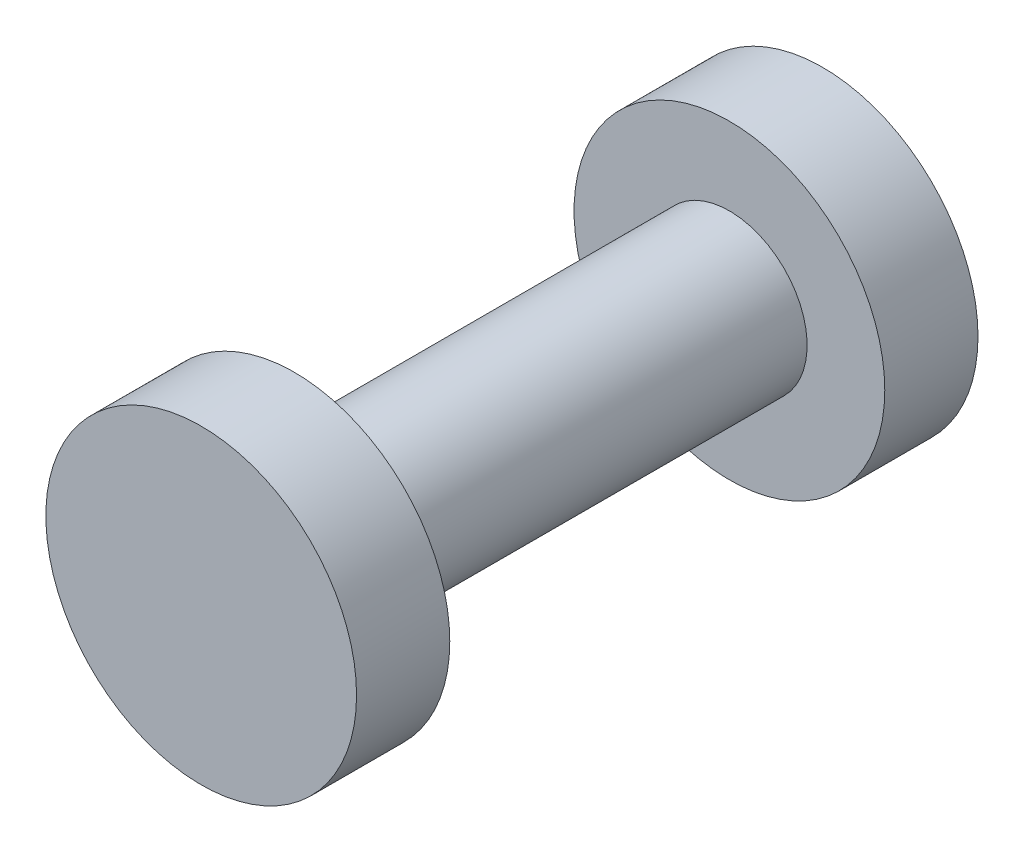
ISO-10303-21;
HEADER;
FILE_DESCRIPTION(('STEP AP214'),'2;1');
FILE_NAME('part.step','',(''),(''),'','','');
FILE_SCHEMA(('AUTOMOTIVE_DESIGN { 1 0 10303 214 1 1 1 1 }'));
ENDSEC;
DATA;
#1=APPLICATION_CONTEXT('core data for automotive mechanical design processes');
#2=APPLICATION_PROTOCOL_DEFINITION('international standard','automotive_design',2000,#1);
#3=PRODUCT_CONTEXT('',#1,'mechanical');
#4=PRODUCT('Part','Part','',(#3));
#5=PRODUCT_RELATED_PRODUCT_CATEGORY('part','',(#4));
#6=PRODUCT_DEFINITION_FORMATION('','',#4);
#7=PRODUCT_DEFINITION_CONTEXT('part definition',#1,'design');
#8=PRODUCT_DEFINITION('design','',#6,#7);
#9=PRODUCT_DEFINITION_SHAPE('','',#8);
#10=(LENGTH_UNIT() NAMED_UNIT(*) SI_UNIT(.MILLI.,.METRE.));
#11=(NAMED_UNIT(*) PLANE_ANGLE_UNIT() SI_UNIT($,.RADIAN.));
#12=(NAMED_UNIT(*) SI_UNIT($,.STERADIAN.) SOLID_ANGLE_UNIT());
#13=UNCERTAINTY_MEASURE_WITH_UNIT(LENGTH_MEASURE(1.E-05),#10,'distance_accuracy_value','');
#14=(GEOMETRIC_REPRESENTATION_CONTEXT(3) GLOBAL_UNCERTAINTY_ASSIGNED_CONTEXT((#13)) GLOBAL_UNIT_ASSIGNED_CONTEXT((#10,
#11,#12)) REPRESENTATION_CONTEXT('',''));
#15=CARTESIAN_POINT('',(0.,0.,0.));
#16=DIRECTION('',(0.,0.,1.));
#17=DIRECTION('',(1.,0.,0.));
#18=AXIS2_PLACEMENT_3D('',#15,#16,#17);
#19=CARTESIAN_POINT('',(0.,0.,6.));
#20=DIRECTION('',(0.,0.,-1.));
#21=DIRECTION('',(-1.,0.,0.));
#22=AXIS2_PLACEMENT_3D('',#19,#20,#21);
#23=CYLINDRICAL_SURFACE('',#22,1.5);
#24=CARTESIAN_POINT('',(0.,0.,4.2));
#25=DIRECTION('',(0.,0.,1.));
#26=DIRECTION('',(1.,0.,0.));
#27=AXIS2_PLACEMENT_3D('',#24,#25,#26);
#28=CIRCLE('',#27,1.5);
#29=CARTESIAN_POINT('',(1.5,0.,4.2));
#30=VERTEX_POINT('',#29);
#31=EDGE_CURVE('E41',#30,#30,#28,.T.);
#32=ORIENTED_EDGE('',*,*,#31,.F.);
#33=EDGE_LOOP('',(#32));
#34=FACE_BOUND('',#33,.T.);
#35=CARTESIAN_POINT('',(0.,0.,-4.2));
#36=DIRECTION('',(0.,0.,-1.));
#37=DIRECTION('',(-1.,0.,0.));
#38=AXIS2_PLACEMENT_3D('',#35,#36,#37);
#39=CIRCLE('',#38,1.5);
#40=CARTESIAN_POINT('',(-1.5,0.,-4.2));
#41=VERTEX_POINT('',#40);
#42=EDGE_CURVE('E10',#41,#41,#39,.T.);
#43=ORIENTED_EDGE('',*,*,#42,.F.);
#44=EDGE_LOOP('',(#43));
#45=FACE_BOUND('',#44,.T.);
#46=ADVANCED_FACE('F35',(#34,#45),#23,.T.);
#47=CARTESIAN_POINT('',(0.,0.,4.2));
#48=DIRECTION('',(0.,0.,1.));
#49=DIRECTION('',(1.,0.,0.));
#50=AXIS2_PLACEMENT_3D('',#47,#48,#49);
#51=CYLINDRICAL_SURFACE('',#50,3.);
#52=CARTESIAN_POINT('',(0.,0.,4.2));
#53=DIRECTION('',(0.,0.,1.));
#54=DIRECTION('',(1.,0.,0.));
#55=AXIS2_PLACEMENT_3D('',#52,#53,#54);
#56=CIRCLE('',#55,3.);
#57=CARTESIAN_POINT('',(3.,0.,4.2));
#58=VERTEX_POINT('',#57);
#59=EDGE_CURVE('E45',#58,#58,#56,.T.);
#60=ORIENTED_EDGE('',*,*,#59,.T.);
#61=EDGE_LOOP('',(#60));
#62=FACE_BOUND('',#61,.T.);
#63=CARTESIAN_POINT('',(0.,0.,6.));
#64=DIRECTION('',(0.,0.,1.));
#65=DIRECTION('',(1.,0.,0.));
#66=AXIS2_PLACEMENT_3D('',#63,#64,#65);
#67=CIRCLE('',#66,3.);
#68=CARTESIAN_POINT('',(3.,0.,6.));
#69=VERTEX_POINT('',#68);
#70=EDGE_CURVE('E49',#69,#69,#67,.T.);
#71=ORIENTED_EDGE('',*,*,#70,.F.);
#72=EDGE_LOOP('',(#71));
#73=FACE_BOUND('',#72,.T.);
#74=ADVANCED_FACE('F78',(#62,#73),#51,.T.);
#75=CARTESIAN_POINT('',(0.,0.,4.2));
#76=DIRECTION('',(0.,0.,1.));
#77=DIRECTION('',(1.,0.,0.));
#78=AXIS2_PLACEMENT_3D('',#75,#76,#77);
#79=PLANE('',#78);
#80=ORIENTED_EDGE('',*,*,#31,.T.);
#81=EDGE_LOOP('',(#80));
#82=FACE_BOUND('',#81,.T.);
#83=ORIENTED_EDGE('',*,*,#59,.F.);
#84=EDGE_LOOP('',(#83));
#85=FACE_BOUND('',#84,.T.);
#86=ADVANCED_FACE('F83',(#82,#85),#79,.F.);
#87=CARTESIAN_POINT('',(0.,0.,6.));
#88=DIRECTION('',(0.,0.,1.));
#89=DIRECTION('',(1.,0.,0.));
#90=AXIS2_PLACEMENT_3D('',#87,#88,#89);
#91=PLANE('',#90);
#92=ORIENTED_EDGE('',*,*,#70,.T.);
#93=EDGE_LOOP('',(#92));
#94=FACE_BOUND('',#93,.T.);
#95=ADVANCED_FACE('F66',(#94),#91,.T.);
#96=CARTESIAN_POINT('',(0.,0.,-4.2));
#97=DIRECTION('',(0.,0.,-1.));
#98=DIRECTION('',(-1.,0.,0.));
#99=AXIS2_PLACEMENT_3D('',#96,#97,#98);
#100=CYLINDRICAL_SURFACE('',#99,3.);
#101=CARTESIAN_POINT('',(0.,0.,-4.2));
#102=DIRECTION('',(0.,0.,1.));
#103=DIRECTION('',(1.,0.,0.));
#104=AXIS2_PLACEMENT_3D('',#101,#102,#103);
#105=CIRCLE('',#104,3.);
#106=CARTESIAN_POINT('',(3.,0.,-4.2));
#107=VERTEX_POINT('',#106);
#108=EDGE_CURVE('E53',#107,#107,#105,.T.);
#109=ORIENTED_EDGE('',*,*,#108,.F.);
#110=EDGE_LOOP('',(#109));
#111=FACE_BOUND('',#110,.T.);
#112=CARTESIAN_POINT('',(0.,0.,-6.));
#113=DIRECTION('',(0.,0.,1.));
#114=DIRECTION('',(1.,0.,0.));
#115=AXIS2_PLACEMENT_3D('',#112,#113,#114);
#116=CIRCLE('',#115,3.);
#117=CARTESIAN_POINT('',(3.,0.,-6.));
#118=VERTEX_POINT('',#117);
#119=EDGE_CURVE('E55',#118,#118,#116,.T.);
#120=ORIENTED_EDGE('',*,*,#119,.T.);
#121=EDGE_LOOP('',(#120));
#122=FACE_BOUND('',#121,.T.);
#123=ADVANCED_FACE('F63',(#111,#122),#100,.T.);
#124=CARTESIAN_POINT('',(0.,0.,-4.2));
#125=DIRECTION('',(0.,0.,-1.));
#126=DIRECTION('',(1.,0.,0.));
#127=AXIS2_PLACEMENT_3D('',#124,#125,#126);
#128=PLANE('',#127);
#129=ORIENTED_EDGE('',*,*,#42,.T.);
#130=EDGE_LOOP('',(#129));
#131=FACE_BOUND('',#130,.T.);
#132=ORIENTED_EDGE('',*,*,#108,.T.);
#133=EDGE_LOOP('',(#132));
#134=FACE_BOUND('',#133,.T.);
#135=ADVANCED_FACE('F61',(#131,#134),#128,.F.);
#136=CARTESIAN_POINT('',(0.,0.,-6.));
#137=DIRECTION('',(0.,0.,1.));
#138=DIRECTION('',(1.,0.,0.));
#139=AXIS2_PLACEMENT_3D('',#136,#137,#138);
#140=PLANE('',#139);
#141=ORIENTED_EDGE('',*,*,#119,.F.);
#142=EDGE_LOOP('',(#141));
#143=FACE_BOUND('',#142,.T.);
#144=ADVANCED_FACE('F70',(#143),#140,.F.);
#145=CLOSED_SHELL('',(#46,#74,#86,#95,#123,#135,#144));
#146=MANIFOLD_SOLID_BREP('B2',#145);
#147=ADVANCED_BREP_SHAPE_REPRESENTATION('',(#18,#146),#14);
#148=SHAPE_DEFINITION_REPRESENTATION(#9,#147);
ENDSEC;
END-ISO-10303-21;
